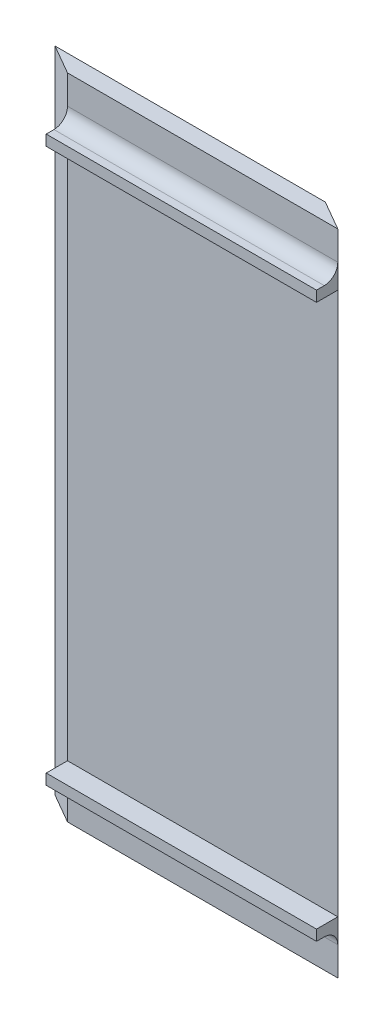
ISO-10303-21;
HEADER;
FILE_DESCRIPTION(('STEP AP214'),'2;1');
FILE_NAME('part.step','',(''),(''),'','','');
FILE_SCHEMA(('AUTOMOTIVE_DESIGN { 1 0 10303 214 1 1 1 1 }'));
ENDSEC;
DATA;
#1=APPLICATION_CONTEXT('core data for automotive mechanical design processes');
#2=APPLICATION_PROTOCOL_DEFINITION('international standard','automotive_design',2000,#1);
#3=PRODUCT_CONTEXT('',#1,'mechanical');
#4=PRODUCT('Part','Part','',(#3));
#5=PRODUCT_RELATED_PRODUCT_CATEGORY('part','',(#4));
#6=PRODUCT_DEFINITION_FORMATION('','',#4);
#7=PRODUCT_DEFINITION_CONTEXT('part definition',#1,'design');
#8=PRODUCT_DEFINITION('design','',#6,#7);
#9=PRODUCT_DEFINITION_SHAPE('','',#8);
#10=(LENGTH_UNIT() NAMED_UNIT(*) SI_UNIT(.MILLI.,.METRE.));
#11=(NAMED_UNIT(*) PLANE_ANGLE_UNIT() SI_UNIT($,.RADIAN.));
#12=(NAMED_UNIT(*) SI_UNIT($,.STERADIAN.) SOLID_ANGLE_UNIT());
#13=UNCERTAINTY_MEASURE_WITH_UNIT(LENGTH_MEASURE(1.E-05),#10,'distance_accuracy_value','');
#14=(GEOMETRIC_REPRESENTATION_CONTEXT(3) GLOBAL_UNCERTAINTY_ASSIGNED_CONTEXT((#13)) GLOBAL_UNIT_ASSIGNED_CONTEXT((#10,
#11,#12)) REPRESENTATION_CONTEXT('',''));
#15=CARTESIAN_POINT('',(0.,0.,0.));
#16=DIRECTION('',(0.,0.,1.));
#17=DIRECTION('',(1.,0.,0.));
#18=AXIS2_PLACEMENT_3D('',#15,#16,#17);
#19=CARTESIAN_POINT('',(0.,0.,0.));
#20=DIRECTION('',(0.,0.,-1.));
#21=DIRECTION('',(-1.,0.,0.));
#22=AXIS2_PLACEMENT_3D('',#19,#20,#21);
#23=PLANE('',#22);
#24=DIRECTION('',(0.,1.,0.));
#25=VECTOR('',#24,1.);
#26=CARTESIAN_POINT('',(53.7926131403121,0.,0.));
#27=LINE('',#26,#25);
#28=CARTESIAN_POINT('',(53.7926131403121,-121.92,0.));
#29=VERTEX_POINT('',#28);
#30=CARTESIAN_POINT('',(53.7926131403121,-116.5,0.));
#31=VERTEX_POINT('',#30);
#32=EDGE_CURVE('E216',#29,#31,#27,.T.);
#33=ORIENTED_EDGE('',*,*,#32,.T.);
#34=DIRECTION('',(1.,0.,0.));
#35=VECTOR('',#34,1.);
#36=CARTESIAN_POINT('',(2.99261314031152,-116.5,0.));
#37=LINE('',#36,#35);
#38=CARTESIAN_POINT('',(2.99261314031155,-116.5,0.));
#39=VERTEX_POINT('',#38);
#40=EDGE_CURVE('E239',#31,#39,#37,.F.);
#41=ORIENTED_EDGE('',*,*,#40,.T.);
#42=DIRECTION('',(0.,-1.,0.));
#43=VECTOR('',#42,1.);
#44=CARTESIAN_POINT('',(2.99261314031152,-121.92,0.));
#45=LINE('',#44,#43);
#46=CARTESIAN_POINT('',(2.99261314031152,-121.92,0.));
#47=VERTEX_POINT('',#46);
#48=EDGE_CURVE('E221',#39,#47,#45,.T.);
#49=ORIENTED_EDGE('',*,*,#48,.T.);
#50=DIRECTION('',(1.,0.,0.));
#51=VECTOR('',#50,1.);
#52=CARTESIAN_POINT('',(53.7926131403121,-121.92,0.));
#53=LINE('',#52,#51);
#54=EDGE_CURVE('E225',#47,#29,#53,.T.);
#55=ORIENTED_EDGE('',*,*,#54,.T.);
#56=EDGE_LOOP('',(#33,#41,#49,#55));
#57=FACE_BOUND('',#56,.T.);
#58=ADVANCED_FACE('F39',(#57),#23,.F.);
#59=DIRECTION('',(-1.,0.,0.));
#60=VECTOR('',#59,1.);
#61=CARTESIAN_POINT('',(2.99261314031151,-111.96,0.));
#62=LINE('',#61,#60);
#63=CARTESIAN_POINT('',(53.7926131403121,-111.96,0.));
#64=VERTEX_POINT('',#63);
#65=CARTESIAN_POINT('',(2.99261314031152,-111.96,0.));
#66=VERTEX_POINT('',#65);
#67=EDGE_CURVE('E156',#64,#66,#62,.T.);
#68=ORIENTED_EDGE('',*,*,#67,.F.);
#69=CARTESIAN_POINT('',(53.7926131403121,-9.95999999999999,0.));
#70=VERTEX_POINT('',#69);
#71=EDGE_CURVE('E231',#64,#70,#27,.T.);
#72=ORIENTED_EDGE('',*,*,#71,.T.);
#73=DIRECTION('',(1.,0.,0.));
#74=VECTOR('',#73,1.);
#75=CARTESIAN_POINT('',(2.99261314031149,-9.95999999999999,0.));
#76=LINE('',#75,#74);
#77=CARTESIAN_POINT('',(2.99261314031152,-9.95999999999998,0.));
#78=VERTEX_POINT('',#77);
#79=EDGE_CURVE('E161',#78,#70,#76,.T.);
#80=ORIENTED_EDGE('',*,*,#79,.F.);
#81=EDGE_CURVE('E226',#78,#66,#45,.T.);
#82=ORIENTED_EDGE('',*,*,#81,.T.);
#83=EDGE_LOOP('',(#68,#72,#80,#82));
#84=FACE_BOUND('',#83,.T.);
#85=ADVANCED_FACE('F265',(#84),#23,.F.);
#86=CARTESIAN_POINT('',(2.99261314031152,0.,0.));
#87=VERTEX_POINT('',#86);
#88=CARTESIAN_POINT('',(2.99261314031152,-5.41999999999999,0.));
#89=VERTEX_POINT('',#88);
#90=EDGE_CURVE('E222',#87,#89,#45,.T.);
#91=ORIENTED_EDGE('',*,*,#90,.T.);
#92=DIRECTION('',(-1.,0.,0.));
#93=VECTOR('',#92,1.);
#94=CARTESIAN_POINT('',(53.7926131403121,-5.41999999999999,0.));
#95=LINE('',#94,#93);
#96=CARTESIAN_POINT('',(53.7926131403121,-5.41999999999999,0.));
#97=VERTEX_POINT('',#96);
#98=EDGE_CURVE('E234',#89,#97,#95,.F.);
#99=ORIENTED_EDGE('',*,*,#98,.T.);
#100=CARTESIAN_POINT('',(53.7926131403121,0.,0.));
#101=VERTEX_POINT('',#100);
#102=EDGE_CURVE('E229',#97,#101,#27,.T.);
#103=ORIENTED_EDGE('',*,*,#102,.T.);
#104=DIRECTION('',(-1.,0.,0.));
#105=VECTOR('',#104,1.);
#106=CARTESIAN_POINT('',(2.99261314031152,0.,0.));
#107=LINE('',#106,#105);
#108=EDGE_CURVE('E212',#101,#87,#107,.T.);
#109=ORIENTED_EDGE('',*,*,#108,.T.);
#110=EDGE_LOOP('',(#91,#99,#103,#109));
#111=FACE_BOUND('',#110,.T.);
#112=ADVANCED_FACE('F286',(#111),#23,.F.);
#113=CARTESIAN_POINT('',(2.99261314031152,0.,-3.2));
#114=DIRECTION('',(0.,1.,0.));
#115=DIRECTION('',(0.,0.,1.));
#116=AXIS2_PLACEMENT_3D('',#113,#114,#115);
#117=PLANE('',#116);
#118=DIRECTION('',(-0.8660254037845,0.,-0.499999999999894));
#119=VECTOR('',#118,1.);
#120=CARTESIAN_POINT('',(48.2500505560901,0.,-3.2));
#121=LINE('',#120,#119);
#122=CARTESIAN_POINT('',(48.2500505560901,0.,-3.2));
#123=VERTEX_POINT('',#122);
#124=EDGE_CURVE('E205',#101,#123,#121,.T.);
#125=ORIENTED_EDGE('',*,*,#124,.T.);
#126=DIRECTION('',(-1.,0.,0.));
#127=VECTOR('',#126,1.);
#128=CARTESIAN_POINT('',(2.99261314031152,0.,-3.2));
#129=LINE('',#128,#127);
#130=CARTESIAN_POINT('',(-2.54994944390992,0.,-3.2));
#131=VERTEX_POINT('',#130);
#132=EDGE_CURVE('E213',#123,#131,#129,.T.);
#133=ORIENTED_EDGE('',*,*,#132,.T.);
#134=DIRECTION('',(-0.866025403784479,0.,-0.49999999999993));
#135=VECTOR('',#134,1.);
#136=CARTESIAN_POINT('',(-2.54994944390992,0.,-3.2));
#137=LINE('',#136,#135);
#138=EDGE_CURVE('E198',#87,#131,#137,.T.);
#139=ORIENTED_EDGE('',*,*,#138,.F.);
#140=ORIENTED_EDGE('',*,*,#108,.F.);
#141=EDGE_LOOP('',(#125,#133,#139,#140));
#142=FACE_BOUND('',#141,.T.);
#143=ADVANCED_FACE('F293',(#142),#117,.T.);
#144=CARTESIAN_POINT('',(53.7926131403121,-121.92,-3.2));
#145=DIRECTION('',(0.,-1.,0.));
#146=DIRECTION('',(0.,0.,-1.));
#147=AXIS2_PLACEMENT_3D('',#144,#145,#146);
#148=PLANE('',#147);
#149=DIRECTION('',(-0.8660254037845,0.,-0.499999999999894));
#150=VECTOR('',#149,1.);
#151=CARTESIAN_POINT('',(48.2500505560901,-121.92,-3.2));
#152=LINE('',#151,#150);
#153=CARTESIAN_POINT('',(48.2500505560901,-121.92,-3.2));
#154=VERTEX_POINT('',#153);
#155=EDGE_CURVE('E204',#29,#154,#152,.T.);
#156=ORIENTED_EDGE('',*,*,#155,.F.);
#157=ORIENTED_EDGE('',*,*,#54,.F.);
#158=DIRECTION('',(-0.866025403784479,0.,-0.49999999999993));
#159=VECTOR('',#158,1.);
#160=CARTESIAN_POINT('',(-2.54994944390992,-121.92,-3.2));
#161=LINE('',#160,#159);
#162=CARTESIAN_POINT('',(-2.54994944390992,-121.92,-3.2));
#163=VERTEX_POINT('',#162);
#164=EDGE_CURVE('E195',#47,#163,#161,.T.);
#165=ORIENTED_EDGE('',*,*,#164,.T.);
#166=DIRECTION('',(1.,0.,0.));
#167=VECTOR('',#166,1.);
#168=CARTESIAN_POINT('',(53.7926131403121,-121.92,-3.2));
#169=LINE('',#168,#167);
#170=EDGE_CURVE('E215',#163,#154,#169,.T.);
#171=ORIENTED_EDGE('',*,*,#170,.T.);
#172=EDGE_LOOP('',(#156,#157,#165,#171));
#173=FACE_BOUND('',#172,.T.);
#174=ADVANCED_FACE('F298',(#173),#148,.T.);
#175=CARTESIAN_POINT('',(0.,0.,-3.2));
#176=DIRECTION('',(0.,0.,-1.));
#177=DIRECTION('',(-1.,0.,0.));
#178=AXIS2_PLACEMENT_3D('',#175,#176,#177);
#179=PLANE('',#178);
#180=DIRECTION('',(0.,-1.,0.));
#181=VECTOR('',#180,1.);
#182=CARTESIAN_POINT('',(48.2500505560901,0.,-3.2));
#183=LINE('',#182,#181);
#184=EDGE_CURVE('E208',#123,#154,#183,.T.);
#185=ORIENTED_EDGE('',*,*,#184,.T.);
#186=ORIENTED_EDGE('',*,*,#170,.F.);
#187=DIRECTION('',(0.,-1.,0.));
#188=VECTOR('',#187,1.);
#189=CARTESIAN_POINT('',(-2.54994944390992,6.40000000000092,-3.2));
#190=LINE('',#189,#188);
#191=EDGE_CURVE('E201',#131,#163,#190,.T.);
#192=ORIENTED_EDGE('',*,*,#191,.F.);
#193=ORIENTED_EDGE('',*,*,#132,.F.);
#194=EDGE_LOOP('',(#185,#186,#192,#193));
#195=FACE_BOUND('',#194,.T.);
#196=ADVANCED_FACE('F338',(#195),#179,.T.);
#197=CARTESIAN_POINT('',(48.2500505560901,0.,-3.2));
#198=DIRECTION('',(-0.499999999999894,0.,0.8660254037845));
#199=DIRECTION('',(0.8660254037845,0.,0.499999999999894));
#200=AXIS2_PLACEMENT_3D('',#197,#198,#199);
#201=PLANE('',#200);
#202=ORIENTED_EDGE('',*,*,#155,.T.);
#203=ORIENTED_EDGE('',*,*,#184,.F.);
#204=ORIENTED_EDGE('',*,*,#124,.F.);
#205=ORIENTED_EDGE('',*,*,#102,.F.);
#206=DIRECTION('',(0.,1.,0.));
#207=VECTOR('',#206,1.);
#208=CARTESIAN_POINT('',(53.792613140312,-9.95999999999999,0.));
#209=LINE('',#208,#207);
#210=EDGE_CURVE('E164',#70,#97,#209,.T.);
#211=ORIENTED_EDGE('',*,*,#210,.F.);
#212=ORIENTED_EDGE('',*,*,#71,.F.);
#213=DIRECTION('',(0.,1.,0.));
#214=VECTOR('',#213,1.);
#215=CARTESIAN_POINT('',(53.792613140312,-111.96,0.));
#216=LINE('',#215,#214);
#217=EDGE_CURVE('E55',#31,#64,#216,.T.);
#218=ORIENTED_EDGE('',*,*,#217,.F.);
#219=ORIENTED_EDGE('',*,*,#32,.F.);
#220=EDGE_LOOP('',(#202,#203,#204,#205,#211,#212,#218,#219));
#221=FACE_BOUND('',#220,.T.);
#222=ADVANCED_FACE('F333',(#221),#201,.F.);
#223=CARTESIAN_POINT('',(-2.54994944390992,6.40000000000092,-3.2));
#224=DIRECTION('',(-0.49999999999993,0.,0.866025403784479));
#225=DIRECTION('',(0.866025403784479,0.,0.49999999999993));
#226=AXIS2_PLACEMENT_3D('',#223,#224,#225);
#227=PLANE('',#226);
#228=ORIENTED_EDGE('',*,*,#90,.F.);
#229=ORIENTED_EDGE('',*,*,#138,.T.);
#230=ORIENTED_EDGE('',*,*,#191,.T.);
#231=ORIENTED_EDGE('',*,*,#164,.F.);
#232=ORIENTED_EDGE('',*,*,#48,.F.);
#233=DIRECTION('',(0.,-1.,0.));
#234=VECTOR('',#233,1.);
#235=CARTESIAN_POINT('',(2.99261314031152,-113.96,0.));
#236=LINE('',#235,#234);
#237=EDGE_CURVE('E261',#66,#39,#236,.T.);
#238=ORIENTED_EDGE('',*,*,#237,.F.);
#239=ORIENTED_EDGE('',*,*,#81,.F.);
#240=DIRECTION('',(0.,-1.,0.));
#241=VECTOR('',#240,1.);
#242=CARTESIAN_POINT('',(2.99261314031151,-7.95999999999999,0.));
#243=LINE('',#242,#241);
#244=EDGE_CURVE('E174',#89,#78,#243,.T.);
#245=ORIENTED_EDGE('',*,*,#244,.F.);
#246=EDGE_LOOP('',(#228,#229,#230,#231,#232,#238,#239,#245));
#247=FACE_BOUND('',#246,.T.);
#248=ADVANCED_FACE('F259',(#247),#227,.T.);
#249=CARTESIAN_POINT('',(2.99261314031149,-9.95999999999999,4.));
#250=DIRECTION('',(0.,1.,0.));
#251=DIRECTION('',(0.,0.,1.));
#252=AXIS2_PLACEMENT_3D('',#249,#250,#251);
#253=PLANE('',#252);
#254=ORIENTED_EDGE('',*,*,#79,.T.);
#255=DIRECTION('',(0.,0.,-1.));
#256=VECTOR('',#255,1.);
#257=CARTESIAN_POINT('',(53.792613140312,-9.95999999999999,4.));
#258=LINE('',#257,#256);
#259=CARTESIAN_POINT('',(53.792613140312,-9.95999999999999,4.));
#260=VERTEX_POINT('',#259);
#261=EDGE_CURVE('E192',#260,#70,#258,.T.);
#262=ORIENTED_EDGE('',*,*,#261,.F.);
#263=DIRECTION('',(1.,0.,0.));
#264=VECTOR('',#263,1.);
#265=CARTESIAN_POINT('',(2.99261314031149,-9.95999999999999,4.));
#266=LINE('',#265,#264);
#267=CARTESIAN_POINT('',(2.99261314031149,-9.95999999999999,4.));
#268=VERTEX_POINT('',#267);
#269=EDGE_CURVE('E170',#268,#260,#266,.T.);
#270=ORIENTED_EDGE('',*,*,#269,.F.);
#271=DIRECTION('',(0.,0.,-1.));
#272=VECTOR('',#271,1.);
#273=CARTESIAN_POINT('',(2.99261314031149,-9.95999999999999,4.));
#274=LINE('',#273,#272);
#275=EDGE_CURVE('E179',#268,#78,#274,.T.);
#276=ORIENTED_EDGE('',*,*,#275,.T.);
#277=EDGE_LOOP('',(#254,#262,#270,#276));
#278=FACE_BOUND('',#277,.T.);
#279=ADVANCED_FACE('F325',(#278),#253,.F.);
#280=CARTESIAN_POINT('',(53.792613140312,-9.95999999999999,4.));
#281=DIRECTION('',(-1.,0.,0.));
#282=DIRECTION('',(0.,-1.,0.));
#283=AXIS2_PLACEMENT_3D('',#280,#281,#282);
#284=PLANE('',#283);
#285=ORIENTED_EDGE('',*,*,#210,.T.);
#286=CARTESIAN_POINT('',(53.7926131403121,-5.41999999999999,2.54));
#287=DIRECTION('',(-1.,0.,0.));
#288=DIRECTION('',(0.,-1.,0.));
#289=AXIS2_PLACEMENT_3D('',#286,#287,#288);
#290=CIRCLE('',#289,2.54);
#291=CARTESIAN_POINT('',(53.792613140312,-7.95999999999999,2.54));
#292=VERTEX_POINT('',#291);
#293=EDGE_CURVE('E245',#97,#292,#290,.T.);
#294=ORIENTED_EDGE('',*,*,#293,.T.);
#295=DIRECTION('',(0.,0.,-1.));
#296=VECTOR('',#295,1.);
#297=CARTESIAN_POINT('',(53.792613140312,-7.95999999999999,4.));
#298=LINE('',#297,#296);
#299=CARTESIAN_POINT('',(53.792613140312,-7.95999999999999,4.));
#300=VERTEX_POINT('',#299);
#301=EDGE_CURVE('E189',#300,#292,#298,.T.);
#302=ORIENTED_EDGE('',*,*,#301,.F.);
#303=DIRECTION('',(0.,1.,0.));
#304=VECTOR('',#303,1.);
#305=CARTESIAN_POINT('',(53.792613140312,-9.95999999999999,4.));
#306=LINE('',#305,#304);
#307=EDGE_CURVE('E173',#260,#300,#306,.T.);
#308=ORIENTED_EDGE('',*,*,#307,.F.);
#309=ORIENTED_EDGE('',*,*,#261,.T.);
#310=EDGE_LOOP('',(#285,#294,#302,#308,#309));
#311=FACE_BOUND('',#310,.T.);
#312=ADVANCED_FACE('F315',(#311),#284,.F.);
#313=CARTESIAN_POINT('',(53.792613140312,-7.95999999999999,4.));
#314=DIRECTION('',(0.,-1.,0.));
#315=DIRECTION('',(1.,0.,0.));
#316=AXIS2_PLACEMENT_3D('',#313,#314,#315);
#317=PLANE('',#316);
#318=ORIENTED_EDGE('',*,*,#301,.T.);
#319=DIRECTION('',(-1.,0.,0.));
#320=VECTOR('',#319,1.);
#321=CARTESIAN_POINT('',(2.99261314031151,-7.95999999999999,2.54));
#322=LINE('',#321,#320);
#323=CARTESIAN_POINT('',(2.99261314031151,-7.95999999999999,2.54));
#324=VERTEX_POINT('',#323);
#325=EDGE_CURVE('E219',#292,#324,#322,.T.);
#326=ORIENTED_EDGE('',*,*,#325,.T.);
#327=DIRECTION('',(0.,0.,-1.));
#328=VECTOR('',#327,1.);
#329=CARTESIAN_POINT('',(2.99261314031151,-7.95999999999999,4.));
#330=LINE('',#329,#328);
#331=CARTESIAN_POINT('',(2.99261314031151,-7.95999999999999,4.));
#332=VERTEX_POINT('',#331);
#333=EDGE_CURVE('E186',#332,#324,#330,.T.);
#334=ORIENTED_EDGE('',*,*,#333,.F.);
#335=DIRECTION('',(-1.,0.,0.));
#336=VECTOR('',#335,1.);
#337=CARTESIAN_POINT('',(53.792613140312,-7.95999999999999,4.));
#338=LINE('',#337,#336);
#339=EDGE_CURVE('E176',#300,#332,#338,.T.);
#340=ORIENTED_EDGE('',*,*,#339,.F.);
#341=EDGE_LOOP('',(#318,#326,#334,#340));
#342=FACE_BOUND('',#341,.T.);
#343=ADVANCED_FACE('F319',(#342),#317,.F.);
#344=CARTESIAN_POINT('',(2.99261314031151,-7.95999999999999,4.));
#345=DIRECTION('',(1.,0.,0.));
#346=DIRECTION('',(0.,1.,0.));
#347=AXIS2_PLACEMENT_3D('',#344,#345,#346);
#348=PLANE('',#347);
#349=ORIENTED_EDGE('',*,*,#244,.T.);
#350=ORIENTED_EDGE('',*,*,#275,.F.);
#351=DIRECTION('',(0.,-1.,0.));
#352=VECTOR('',#351,1.);
#353=CARTESIAN_POINT('',(2.99261314031151,-7.95999999999999,4.));
#354=LINE('',#353,#352);
#355=EDGE_CURVE('E178',#332,#268,#354,.T.);
#356=ORIENTED_EDGE('',*,*,#355,.F.);
#357=ORIENTED_EDGE('',*,*,#333,.T.);
#358=CARTESIAN_POINT('',(2.99261314031153,-5.41999999999999,2.54));
#359=DIRECTION('',(1.,0.,0.));
#360=DIRECTION('',(0.,1.,0.));
#361=AXIS2_PLACEMENT_3D('',#358,#359,#360);
#362=CIRCLE('',#361,2.54);
#363=EDGE_CURVE('E242',#324,#89,#362,.T.);
#364=ORIENTED_EDGE('',*,*,#363,.T.);
#365=EDGE_LOOP('',(#349,#350,#356,#357,#364));
#366=FACE_BOUND('',#365,.T.);
#367=ADVANCED_FACE('F306',(#366),#348,.F.);
#368=CARTESIAN_POINT('',(0.,0.,4.));
#369=DIRECTION('',(0.,0.,1.));
#370=DIRECTION('',(1.,0.,0.));
#371=AXIS2_PLACEMENT_3D('',#368,#369,#370);
#372=PLANE('',#371);
#373=ORIENTED_EDGE('',*,*,#269,.T.);
#374=ORIENTED_EDGE('',*,*,#307,.T.);
#375=ORIENTED_EDGE('',*,*,#339,.T.);
#376=ORIENTED_EDGE('',*,*,#355,.T.);
#377=EDGE_LOOP('',(#373,#374,#375,#376));
#378=FACE_BOUND('',#377,.T.);
#379=ADVANCED_FACE('F321',(#378),#372,.T.);
#380=CARTESIAN_POINT('',(2.99261314031152,-113.96,4.));
#381=DIRECTION('',(1.,0.,0.));
#382=DIRECTION('',(0.,1.,0.));
#383=AXIS2_PLACEMENT_3D('',#380,#381,#382);
#384=PLANE('',#383);
#385=ORIENTED_EDGE('',*,*,#237,.T.);
#386=CARTESIAN_POINT('',(2.99261314031155,-116.5,2.54));
#387=DIRECTION('',(1.,0.,0.));
#388=DIRECTION('',(0.,1.,0.));
#389=AXIS2_PLACEMENT_3D('',#386,#387,#388);
#390=CIRCLE('',#389,2.54);
#391=CARTESIAN_POINT('',(2.99261314031152,-113.96,2.54));
#392=VERTEX_POINT('',#391);
#393=EDGE_CURVE('E11',#39,#392,#390,.T.);
#394=ORIENTED_EDGE('',*,*,#393,.T.);
#395=DIRECTION('',(0.,0.,-1.));
#396=VECTOR('',#395,1.);
#397=CARTESIAN_POINT('',(2.99261314031152,-113.96,4.));
#398=LINE('',#397,#396);
#399=CARTESIAN_POINT('',(2.99261314031152,-113.96,4.));
#400=VERTEX_POINT('',#399);
#401=EDGE_CURVE('E140',#400,#392,#398,.T.);
#402=ORIENTED_EDGE('',*,*,#401,.F.);
#403=DIRECTION('',(0.,-1.,0.));
#404=VECTOR('',#403,1.);
#405=CARTESIAN_POINT('',(2.99261314031152,-113.96,4.));
#406=LINE('',#405,#404);
#407=CARTESIAN_POINT('',(2.99261314031151,-111.96,4.));
#408=VERTEX_POINT('',#407);
#409=EDGE_CURVE('E147',#408,#400,#406,.T.);
#410=ORIENTED_EDGE('',*,*,#409,.F.);
#411=DIRECTION('',(0.,0.,-1.));
#412=VECTOR('',#411,1.);
#413=CARTESIAN_POINT('',(2.99261314031151,-111.96,4.));
#414=LINE('',#413,#412);
#415=EDGE_CURVE('E268',#408,#66,#414,.T.);
#416=ORIENTED_EDGE('',*,*,#415,.T.);
#417=EDGE_LOOP('',(#385,#394,#402,#410,#416));
#418=FACE_BOUND('',#417,.T.);
#419=ADVANCED_FACE('F159',(#418),#384,.F.);
#420=CARTESIAN_POINT('',(53.792613140312,-113.96,4.));
#421=DIRECTION('',(0.,1.,0.));
#422=DIRECTION('',(-1.,0.,0.));
#423=AXIS2_PLACEMENT_3D('',#420,#421,#422);
#424=PLANE('',#423);
#425=ORIENTED_EDGE('',*,*,#401,.T.);
#426=DIRECTION('',(1.,0.,0.));
#427=VECTOR('',#426,1.);
#428=CARTESIAN_POINT('',(53.7926131403121,-113.96,2.54));
#429=LINE('',#428,#427);
#430=CARTESIAN_POINT('',(53.792613140312,-113.96,2.54));
#431=VERTEX_POINT('',#430);
#432=EDGE_CURVE('E237',#392,#431,#429,.T.);
#433=ORIENTED_EDGE('',*,*,#432,.T.);
#434=DIRECTION('',(0.,0.,-1.));
#435=VECTOR('',#434,1.);
#436=CARTESIAN_POINT('',(53.792613140312,-113.96,4.));
#437=LINE('',#436,#435);
#438=CARTESIAN_POINT('',(53.792613140312,-113.96,4.));
#439=VERTEX_POINT('',#438);
#440=EDGE_CURVE('E143',#439,#431,#437,.T.);
#441=ORIENTED_EDGE('',*,*,#440,.F.);
#442=DIRECTION('',(1.,0.,0.));
#443=VECTOR('',#442,1.);
#444=CARTESIAN_POINT('',(53.792613140312,-113.96,4.));
#445=LINE('',#444,#443);
#446=EDGE_CURVE('E135',#400,#439,#445,.T.);
#447=ORIENTED_EDGE('',*,*,#446,.F.);
#448=EDGE_LOOP('',(#425,#433,#441,#447));
#449=FACE_BOUND('',#448,.T.);
#450=ADVANCED_FACE('F137',(#449),#424,.F.);
#451=CARTESIAN_POINT('',(53.792613140312,-111.96,4.));
#452=DIRECTION('',(-1.,0.,0.));
#453=DIRECTION('',(0.,-1.,0.));
#454=AXIS2_PLACEMENT_3D('',#451,#452,#453);
#455=PLANE('',#454);
#456=ORIENTED_EDGE('',*,*,#217,.T.);
#457=DIRECTION('',(0.,0.,-1.));
#458=VECTOR('',#457,1.);
#459=CARTESIAN_POINT('',(53.792613140312,-111.96,4.));
#460=LINE('',#459,#458);
#461=CARTESIAN_POINT('',(53.792613140312,-111.96,4.));
#462=VERTEX_POINT('',#461);
#463=EDGE_CURVE('E166',#462,#64,#460,.T.);
#464=ORIENTED_EDGE('',*,*,#463,.F.);
#465=DIRECTION('',(0.,1.,0.));
#466=VECTOR('',#465,1.);
#467=CARTESIAN_POINT('',(53.792613140312,-111.96,4.));
#468=LINE('',#467,#466);
#469=EDGE_CURVE('E146',#439,#462,#468,.T.);
#470=ORIENTED_EDGE('',*,*,#469,.F.);
#471=ORIENTED_EDGE('',*,*,#440,.T.);
#472=CARTESIAN_POINT('',(53.7926131403121,-116.5,2.54));
#473=DIRECTION('',(-1.,0.,0.));
#474=DIRECTION('',(0.,-1.,0.));
#475=AXIS2_PLACEMENT_3D('',#472,#473,#474);
#476=CIRCLE('',#475,2.54);
#477=EDGE_CURVE('E48',#431,#31,#476,.T.);
#478=ORIENTED_EDGE('',*,*,#477,.T.);
#479=EDGE_LOOP('',(#456,#464,#470,#471,#478));
#480=FACE_BOUND('',#479,.T.);
#481=ADVANCED_FACE('F249',(#480),#455,.F.);
#482=CARTESIAN_POINT('',(2.99261314031151,-111.96,4.));
#483=DIRECTION('',(0.,-1.,0.));
#484=DIRECTION('',(1.,0.,0.));
#485=AXIS2_PLACEMENT_3D('',#482,#483,#484);
#486=PLANE('',#485);
#487=ORIENTED_EDGE('',*,*,#67,.T.);
#488=ORIENTED_EDGE('',*,*,#415,.F.);
#489=DIRECTION('',(-1.,0.,0.));
#490=VECTOR('',#489,1.);
#491=CARTESIAN_POINT('',(2.99261314031151,-111.96,4.));
#492=LINE('',#491,#490);
#493=EDGE_CURVE('E152',#462,#408,#492,.T.);
#494=ORIENTED_EDGE('',*,*,#493,.F.);
#495=ORIENTED_EDGE('',*,*,#463,.T.);
#496=EDGE_LOOP('',(#487,#488,#494,#495));
#497=FACE_BOUND('',#496,.T.);
#498=ADVANCED_FACE('F267',(#497),#486,.F.);
#499=CARTESIAN_POINT('',(0.,0.,4.));
#500=DIRECTION('',(0.,0.,-1.));
#501=DIRECTION('',(-1.,0.,0.));
#502=AXIS2_PLACEMENT_3D('',#499,#500,#501);
#503=PLANE('',#502);
#504=ORIENTED_EDGE('',*,*,#409,.T.);
#505=ORIENTED_EDGE('',*,*,#446,.T.);
#506=ORIENTED_EDGE('',*,*,#469,.T.);
#507=ORIENTED_EDGE('',*,*,#493,.T.);
#508=EDGE_LOOP('',(#504,#505,#506,#507));
#509=FACE_BOUND('',#508,.T.);
#510=ADVANCED_FACE('F150',(#509),#503,.F.);
#511=CARTESIAN_POINT('',(53.792613140312,-5.41999999999999,2.54));
#512=DIRECTION('',(1.,0.,0.));
#513=DIRECTION('',(0.,1.,0.));
#514=AXIS2_PLACEMENT_3D('',#511,#512,#513);
#515=CYLINDRICAL_SURFACE('',#514,2.54);
#516=ORIENTED_EDGE('',*,*,#293,.F.);
#517=ORIENTED_EDGE('',*,*,#98,.F.);
#518=ORIENTED_EDGE('',*,*,#363,.F.);
#519=ORIENTED_EDGE('',*,*,#325,.F.);
#520=EDGE_LOOP('',(#516,#517,#518,#519));
#521=FACE_BOUND('',#520,.T.);
#522=ADVANCED_FACE('F281',(#521),#515,.F.);
#523=CARTESIAN_POINT('',(53.792613140312,-116.5,2.54));
#524=DIRECTION('',(-1.,0.,0.));
#525=DIRECTION('',(0.,-1.,0.));
#526=AXIS2_PLACEMENT_3D('',#523,#524,#525);
#527=CYLINDRICAL_SURFACE('',#526,2.54);
#528=ORIENTED_EDGE('',*,*,#393,.F.);
#529=ORIENTED_EDGE('',*,*,#40,.F.);
#530=ORIENTED_EDGE('',*,*,#477,.F.);
#531=ORIENTED_EDGE('',*,*,#432,.F.);
#532=EDGE_LOOP('',(#528,#529,#530,#531));
#533=FACE_BOUND('',#532,.T.);
#534=ADVANCED_FACE('F41',(#533),#527,.F.);
#535=CLOSED_SHELL('',(#58,#85,#112,#143,#174,#196,#222,#248,#279,#312,#343,#367,#379,#419,#450,
#481,#498,#510,#522,#534));
#536=MANIFOLD_SOLID_BREP('B2',#535);
#537=ADVANCED_BREP_SHAPE_REPRESENTATION('',(#18,#536),#14);
#538=SHAPE_DEFINITION_REPRESENTATION(#9,#537);
ENDSEC;
END-ISO-10303-21;
